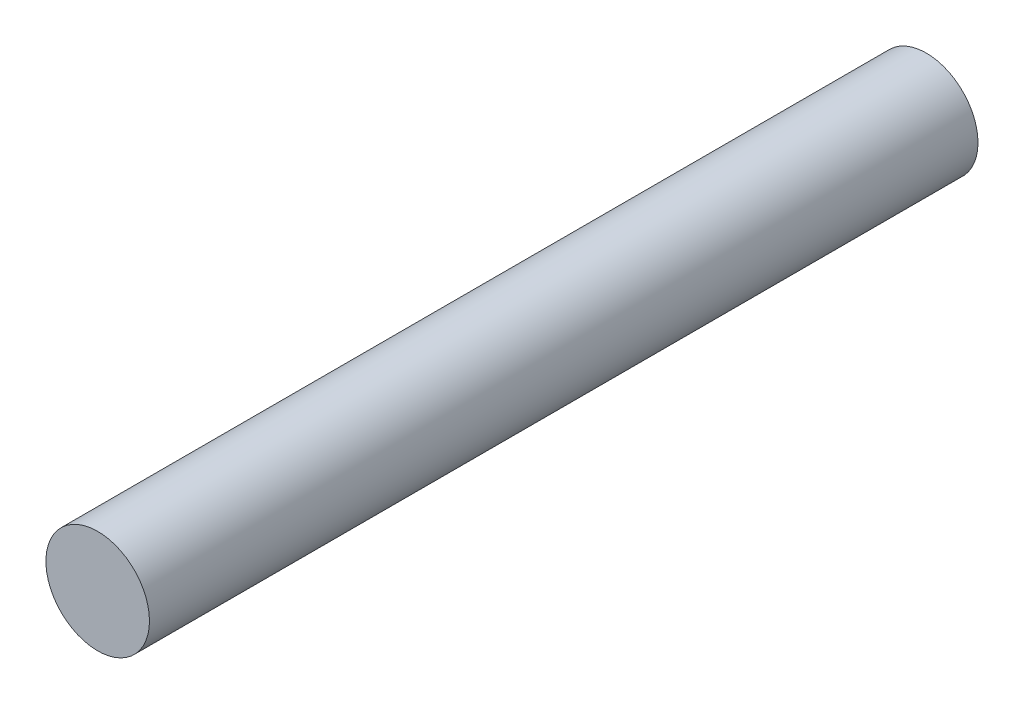
ISO-10303-21;
HEADER;
FILE_DESCRIPTION(('STEP AP214'),'2;1');
FILE_NAME('part.step','',(''),(''),'','','');
FILE_SCHEMA(('AUTOMOTIVE_DESIGN { 1 0 10303 214 1 1 1 1 }'));
ENDSEC;
DATA;
#1=APPLICATION_CONTEXT('core data for automotive mechanical design processes');
#2=APPLICATION_PROTOCOL_DEFINITION('international standard','automotive_design',2000,#1);
#3=PRODUCT_CONTEXT('',#1,'mechanical');
#4=PRODUCT('Part','Part','',(#3));
#5=PRODUCT_RELATED_PRODUCT_CATEGORY('part','',(#4));
#6=PRODUCT_DEFINITION_FORMATION('','',#4);
#7=PRODUCT_DEFINITION_CONTEXT('part definition',#1,'design');
#8=PRODUCT_DEFINITION('design','',#6,#7);
#9=PRODUCT_DEFINITION_SHAPE('','',#8);
#10=(LENGTH_UNIT() NAMED_UNIT(*) SI_UNIT(.MILLI.,.METRE.));
#11=(NAMED_UNIT(*) PLANE_ANGLE_UNIT() SI_UNIT($,.RADIAN.));
#12=(NAMED_UNIT(*) SI_UNIT($,.STERADIAN.) SOLID_ANGLE_UNIT());
#13=UNCERTAINTY_MEASURE_WITH_UNIT(LENGTH_MEASURE(1.E-05),#10,'distance_accuracy_value','');
#14=(GEOMETRIC_REPRESENTATION_CONTEXT(3) GLOBAL_UNCERTAINTY_ASSIGNED_CONTEXT((#13)) GLOBAL_UNIT_ASSIGNED_CONTEXT((#10,
#11,#12)) REPRESENTATION_CONTEXT('',''));
#15=CARTESIAN_POINT('',(0.,0.,0.));
#16=DIRECTION('',(0.,0.,1.));
#17=DIRECTION('',(1.,0.,0.));
#18=AXIS2_PLACEMENT_3D('',#15,#16,#17);
#19=CARTESIAN_POINT('',(0.,0.,50.8));
#20=DIRECTION('',(0.,0.,-1.));
#21=DIRECTION('',(-1.,0.,0.));
#22=AXIS2_PLACEMENT_3D('',#19,#20,#21);
#23=CYLINDRICAL_SURFACE('',#22,3.175);
#24=CARTESIAN_POINT('',(0.,0.,50.8));
#25=DIRECTION('',(0.,0.,1.));
#26=DIRECTION('',(1.,0.,0.));
#27=AXIS2_PLACEMENT_3D('',#24,#25,#26);
#28=CIRCLE('',#27,3.175);
#29=CARTESIAN_POINT('',(3.175,0.,50.8));
#30=VERTEX_POINT('',#29);
#31=EDGE_CURVE('E10',#30,#30,#28,.T.);
#32=ORIENTED_EDGE('',*,*,#31,.F.);
#33=EDGE_LOOP('',(#32));
#34=FACE_BOUND('',#33,.T.);
#35=CARTESIAN_POINT('',(0.,0.,0.));
#36=DIRECTION('',(0.,0.,1.));
#37=DIRECTION('',(1.,0.,0.));
#38=AXIS2_PLACEMENT_3D('',#35,#36,#37);
#39=CIRCLE('',#38,3.175);
#40=CARTESIAN_POINT('',(3.175,0.,0.));
#41=VERTEX_POINT('',#40);
#42=EDGE_CURVE('E38',#41,#41,#39,.T.);
#43=ORIENTED_EDGE('',*,*,#42,.T.);
#44=EDGE_LOOP('',(#43));
#45=FACE_BOUND('',#44,.T.);
#46=ADVANCED_FACE('F35',(#34,#45),#23,.T.);
#47=CARTESIAN_POINT('',(0.,0.,50.8));
#48=DIRECTION('',(0.,0.,1.));
#49=DIRECTION('',(1.,0.,0.));
#50=AXIS2_PLACEMENT_3D('',#47,#48,#49);
#51=PLANE('',#50);
#52=ORIENTED_EDGE('',*,*,#31,.T.);
#53=EDGE_LOOP('',(#52));
#54=FACE_BOUND('',#53,.T.);
#55=ADVANCED_FACE('F50',(#54),#51,.T.);
#56=CARTESIAN_POINT('',(0.,0.,0.));
#57=DIRECTION('',(0.,0.,1.));
#58=DIRECTION('',(1.,0.,0.));
#59=AXIS2_PLACEMENT_3D('',#56,#57,#58);
#60=PLANE('',#59);
#61=ORIENTED_EDGE('',*,*,#42,.F.);
#62=EDGE_LOOP('',(#61));
#63=FACE_BOUND('',#62,.T.);
#64=ADVANCED_FACE('F48',(#63),#60,.F.);
#65=CLOSED_SHELL('',(#46,#55,#64));
#66=MANIFOLD_SOLID_BREP('B2',#65);
#67=ADVANCED_BREP_SHAPE_REPRESENTATION('',(#18,#66),#14);
#68=SHAPE_DEFINITION_REPRESENTATION(#9,#67);
ENDSEC;
END-ISO-10303-21;
